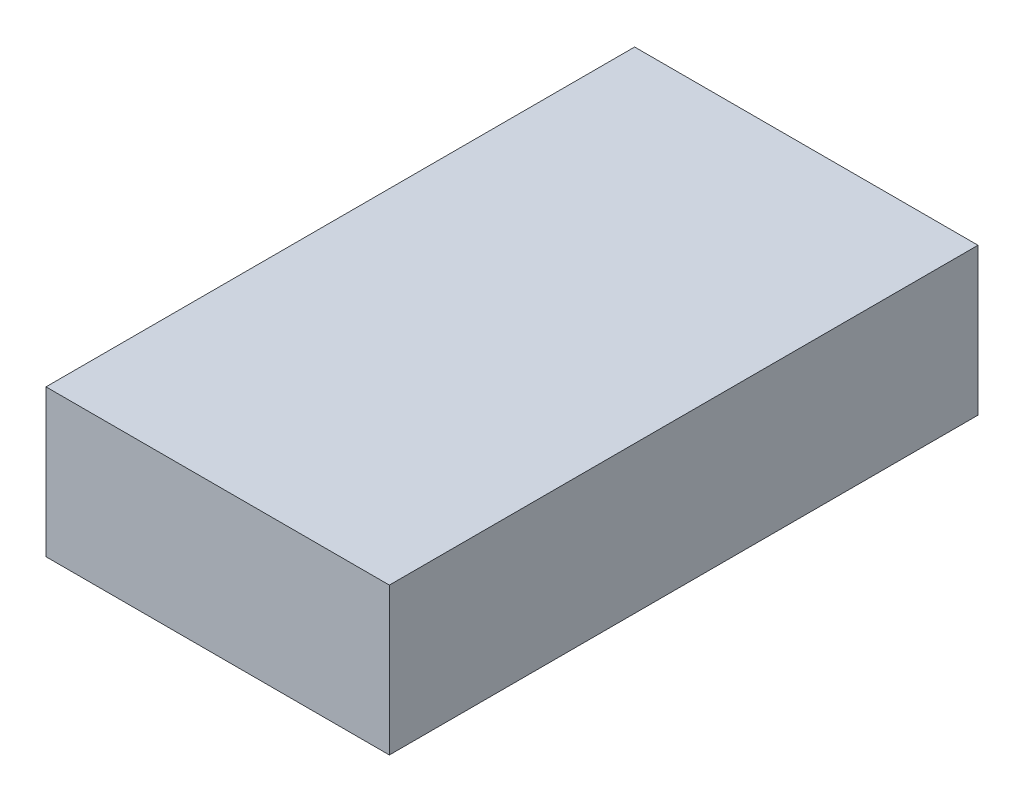
ISO-10303-21;
HEADER;
FILE_DESCRIPTION(('STEP AP214'),'2;1');
FILE_NAME('part.step','',(''),(''),'','','');
FILE_SCHEMA(('AUTOMOTIVE_DESIGN { 1 0 10303 214 1 1 1 1 }'));
ENDSEC;
DATA;
#1=APPLICATION_CONTEXT('core data for automotive mechanical design processes');
#2=APPLICATION_PROTOCOL_DEFINITION('international standard','automotive_design',2000,#1);
#3=PRODUCT_CONTEXT('',#1,'mechanical');
#4=PRODUCT('Part','Part','',(#3));
#5=PRODUCT_RELATED_PRODUCT_CATEGORY('part','',(#4));
#6=PRODUCT_DEFINITION_FORMATION('','',#4);
#7=PRODUCT_DEFINITION_CONTEXT('part definition',#1,'design');
#8=PRODUCT_DEFINITION('design','',#6,#7);
#9=PRODUCT_DEFINITION_SHAPE('','',#8);
#10=(LENGTH_UNIT() NAMED_UNIT(*) SI_UNIT(.MILLI.,.METRE.));
#11=(NAMED_UNIT(*) PLANE_ANGLE_UNIT() SI_UNIT($,.RADIAN.));
#12=(NAMED_UNIT(*) SI_UNIT($,.STERADIAN.) SOLID_ANGLE_UNIT());
#13=UNCERTAINTY_MEASURE_WITH_UNIT(LENGTH_MEASURE(1.E-05),#10,'distance_accuracy_value','');
#14=(GEOMETRIC_REPRESENTATION_CONTEXT(3) GLOBAL_UNCERTAINTY_ASSIGNED_CONTEXT((#13)) GLOBAL_UNIT_ASSIGNED_CONTEXT((#10,
#11,#12)) REPRESENTATION_CONTEXT('',''));
#15=CARTESIAN_POINT('',(0.,0.,0.));
#16=DIRECTION('',(0.,0.,1.));
#17=DIRECTION('',(1.,0.,0.));
#18=AXIS2_PLACEMENT_3D('',#15,#16,#17);
#19=CARTESIAN_POINT('',(0.,15.,0.));
#20=DIRECTION('',(0.,1.,0.));
#21=DIRECTION('',(0.,0.,1.));
#22=AXIS2_PLACEMENT_3D('',#19,#20,#21);
#23=PLANE('',#22);
#24=DIRECTION('',(-1.,0.,0.));
#25=VECTOR('',#24,1.);
#26=CARTESIAN_POINT('',(17.,14.9999999999999,-30.));
#27=LINE('',#26,#25);
#28=CARTESIAN_POINT('',(-18.,14.9999999999999,-30.));
#29=VERTEX_POINT('',#28);
#30=CARTESIAN_POINT('',(17.,14.9999999999999,-30.));
#31=VERTEX_POINT('',#30);
#32=EDGE_CURVE('E67',#29,#31,#27,.F.);
#33=ORIENTED_EDGE('',*,*,#32,.F.);
#34=DIRECTION('',(0.,0.,1.));
#35=VECTOR('',#34,1.);
#36=CARTESIAN_POINT('',(-18.,14.9999999999999,-30.));
#37=LINE('',#36,#35);
#38=CARTESIAN_POINT('',(-18.,15.,30.0000000000002));
#39=VERTEX_POINT('',#38);
#40=EDGE_CURVE('E19',#39,#29,#37,.F.);
#41=ORIENTED_EDGE('',*,*,#40,.F.);
#42=DIRECTION('',(1.,0.,0.));
#43=VECTOR('',#42,1.);
#44=CARTESIAN_POINT('',(-18.,15.,30.0000000000002));
#45=LINE('',#44,#43);
#46=CARTESIAN_POINT('',(17.,15.,30.0000000000002));
#47=VERTEX_POINT('',#46);
#48=EDGE_CURVE('E57',#47,#39,#45,.F.);
#49=ORIENTED_EDGE('',*,*,#48,.F.);
#50=DIRECTION('',(0.,0.,-1.));
#51=VECTOR('',#50,1.);
#52=CARTESIAN_POINT('',(17.,15.,30.0000000000002));
#53=LINE('',#52,#51);
#54=EDGE_CURVE('E52',#31,#47,#53,.F.);
#55=ORIENTED_EDGE('',*,*,#54,.F.);
#56=EDGE_LOOP('',(#33,#41,#49,#55));
#57=FACE_BOUND('',#56,.T.);
#58=ADVANCED_FACE('F16',(#57),#23,.T.);
#59=CARTESIAN_POINT('',(-18.,0.,-30.));
#60=DIRECTION('',(-1.,0.,0.));
#61=DIRECTION('',(0.,0.,1.));
#62=AXIS2_PLACEMENT_3D('',#59,#60,#61);
#63=PLANE('',#62);
#64=DIRECTION('',(0.,1.,0.));
#65=VECTOR('',#64,1.);
#66=CARTESIAN_POINT('',(-18.,0.,-30.));
#67=LINE('',#66,#65);
#68=CARTESIAN_POINT('',(-18.,0.,-30.));
#69=VERTEX_POINT('',#68);
#70=EDGE_CURVE('E78',#69,#29,#67,.T.);
#71=ORIENTED_EDGE('',*,*,#70,.F.);
#72=DIRECTION('',(0.,0.,1.));
#73=VECTOR('',#72,1.);
#74=CARTESIAN_POINT('',(-18.,0.,0.));
#75=LINE('',#74,#73);
#76=CARTESIAN_POINT('',(-18.,0.,30.0000000000001));
#77=VERTEX_POINT('',#76);
#78=EDGE_CURVE('E73',#69,#77,#75,.T.);
#79=ORIENTED_EDGE('',*,*,#78,.T.);
#80=DIRECTION('',(0.,1.,0.));
#81=VECTOR('',#80,1.);
#82=CARTESIAN_POINT('',(-18.,0.,30.0000000000001));
#83=LINE('',#82,#81);
#84=EDGE_CURVE('E62',#39,#77,#83,.F.);
#85=ORIENTED_EDGE('',*,*,#84,.F.);
#86=ORIENTED_EDGE('',*,*,#40,.T.);
#87=EDGE_LOOP('',(#71,#79,#85,#86));
#88=FACE_BOUND('',#87,.T.);
#89=ADVANCED_FACE('F72',(#88),#63,.T.);
#90=CARTESIAN_POINT('',(-18.,0.,30.0000000000001));
#91=DIRECTION('',(0.,0.,1.));
#92=DIRECTION('',(1.,0.,0.));
#93=AXIS2_PLACEMENT_3D('',#90,#91,#92);
#94=PLANE('',#93);
#95=ORIENTED_EDGE('',*,*,#84,.T.);
#96=DIRECTION('',(1.,0.,0.));
#97=VECTOR('',#96,1.);
#98=CARTESIAN_POINT('',(0.,0.,30.0000000000001));
#99=LINE('',#98,#97);
#100=CARTESIAN_POINT('',(17.,0.,30.0000000000001));
#101=VERTEX_POINT('',#100);
#102=EDGE_CURVE('E83',#77,#101,#99,.T.);
#103=ORIENTED_EDGE('',*,*,#102,.T.);
#104=DIRECTION('',(0.,1.,0.));
#105=VECTOR('',#104,1.);
#106=CARTESIAN_POINT('',(17.,0.,30.0000000000001));
#107=LINE('',#106,#105);
#108=EDGE_CURVE('E64',#47,#101,#107,.F.);
#109=ORIENTED_EDGE('',*,*,#108,.F.);
#110=ORIENTED_EDGE('',*,*,#48,.T.);
#111=EDGE_LOOP('',(#95,#103,#109,#110));
#112=FACE_BOUND('',#111,.T.);
#113=ADVANCED_FACE('F59',(#112),#94,.T.);
#114=CARTESIAN_POINT('',(17.,0.,30.0000000000001));
#115=DIRECTION('',(1.,0.,0.));
#116=DIRECTION('',(0.,0.,-1.));
#117=AXIS2_PLACEMENT_3D('',#114,#115,#116);
#118=PLANE('',#117);
#119=ORIENTED_EDGE('',*,*,#108,.T.);
#120=DIRECTION('',(0.,0.,1.));
#121=VECTOR('',#120,1.);
#122=CARTESIAN_POINT('',(17.,0.,0.));
#123=LINE('',#122,#121);
#124=CARTESIAN_POINT('',(17.,0.,-30.));
#125=VERTEX_POINT('',#124);
#126=EDGE_CURVE('E25',#101,#125,#123,.F.);
#127=ORIENTED_EDGE('',*,*,#126,.T.);
#128=DIRECTION('',(0.,1.,0.));
#129=VECTOR('',#128,1.);
#130=CARTESIAN_POINT('',(17.,0.,-30.));
#131=LINE('',#130,#129);
#132=EDGE_CURVE('E33',#31,#125,#131,.F.);
#133=ORIENTED_EDGE('',*,*,#132,.F.);
#134=ORIENTED_EDGE('',*,*,#54,.T.);
#135=EDGE_LOOP('',(#119,#127,#133,#134));
#136=FACE_BOUND('',#135,.T.);
#137=ADVANCED_FACE('F87',(#136),#118,.T.);
#138=CARTESIAN_POINT('',(17.,0.,-30.));
#139=DIRECTION('',(0.,0.,-1.));
#140=DIRECTION('',(-1.,0.,0.));
#141=AXIS2_PLACEMENT_3D('',#138,#139,#140);
#142=PLANE('',#141);
#143=ORIENTED_EDGE('',*,*,#132,.T.);
#144=DIRECTION('',(1.,0.,0.));
#145=VECTOR('',#144,1.);
#146=CARTESIAN_POINT('',(0.,0.,-30.));
#147=LINE('',#146,#145);
#148=EDGE_CURVE('E11',#125,#69,#147,.F.);
#149=ORIENTED_EDGE('',*,*,#148,.T.);
#150=ORIENTED_EDGE('',*,*,#70,.T.);
#151=ORIENTED_EDGE('',*,*,#32,.T.);
#152=EDGE_LOOP('',(#143,#149,#150,#151));
#153=FACE_BOUND('',#152,.T.);
#154=ADVANCED_FACE('F90',(#153),#142,.T.);
#155=CARTESIAN_POINT('',(0.,0.,0.));
#156=DIRECTION('',(0.,1.,0.));
#157=DIRECTION('',(0.,0.,1.));
#158=AXIS2_PLACEMENT_3D('',#155,#156,#157);
#159=PLANE('',#158);
#160=ORIENTED_EDGE('',*,*,#126,.F.);
#161=ORIENTED_EDGE('',*,*,#102,.F.);
#162=ORIENTED_EDGE('',*,*,#78,.F.);
#163=ORIENTED_EDGE('',*,*,#148,.F.);
#164=EDGE_LOOP('',(#160,#161,#162,#163));
#165=FACE_BOUND('',#164,.T.);
#166=ADVANCED_FACE('F89',(#165),#159,.F.);
#167=CLOSED_SHELL('',(#58,#89,#113,#137,#154,#166));
#168=MANIFOLD_SOLID_BREP('B1',#167);
#169=ADVANCED_BREP_SHAPE_REPRESENTATION('',(#18,#168),#14);
#170=SHAPE_DEFINITION_REPRESENTATION(#9,#169);
ENDSEC;
END-ISO-10303-21;
